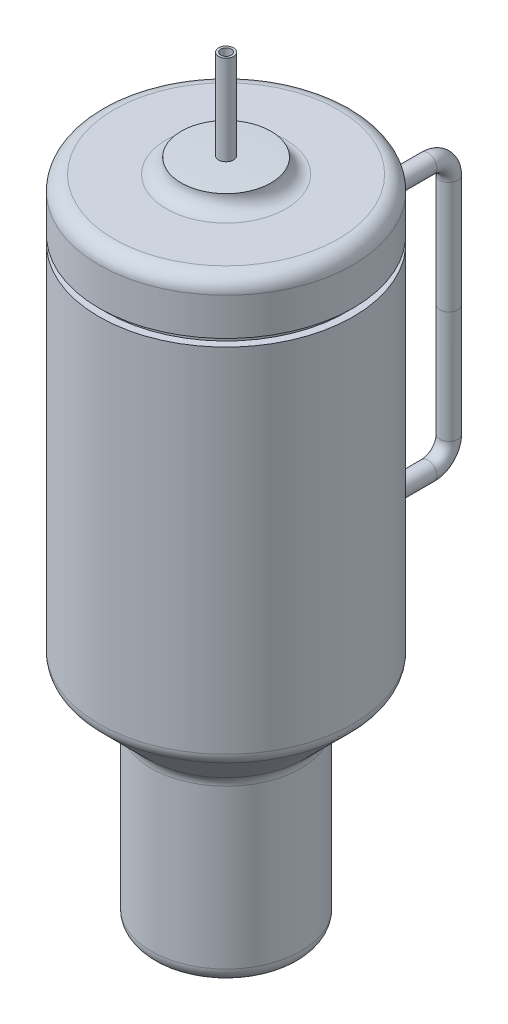
ISO-10303-21;
HEADER;
FILE_DESCRIPTION(('STEP AP214'),'2;1');
FILE_NAME('part.step','',(''),(''),'','','');
FILE_SCHEMA(('AUTOMOTIVE_DESIGN { 1 0 10303 214 1 1 1 1 }'));
ENDSEC;
DATA;
#1=APPLICATION_CONTEXT('core data for automotive mechanical design processes');
#2=APPLICATION_PROTOCOL_DEFINITION('international standard','automotive_design',2000,#1);
#3=PRODUCT_CONTEXT('',#1,'mechanical');
#4=PRODUCT('Part','Part','',(#3));
#5=PRODUCT_RELATED_PRODUCT_CATEGORY('part','',(#4));
#6=PRODUCT_DEFINITION_FORMATION('','',#4);
#7=PRODUCT_DEFINITION_CONTEXT('part definition',#1,'design');
#8=PRODUCT_DEFINITION('design','',#6,#7);
#9=PRODUCT_DEFINITION_SHAPE('','',#8);
#10=(LENGTH_UNIT() NAMED_UNIT(*) SI_UNIT(.MILLI.,.METRE.));
#11=(NAMED_UNIT(*) PLANE_ANGLE_UNIT() SI_UNIT($,.RADIAN.));
#12=(NAMED_UNIT(*) SI_UNIT($,.STERADIAN.) SOLID_ANGLE_UNIT());
#13=UNCERTAINTY_MEASURE_WITH_UNIT(LENGTH_MEASURE(1.E-05),#10,'distance_accuracy_value','');
#14=(GEOMETRIC_REPRESENTATION_CONTEXT(3) GLOBAL_UNCERTAINTY_ASSIGNED_CONTEXT((#13)) GLOBAL_UNIT_ASSIGNED_CONTEXT((#10,
#11,#12)) REPRESENTATION_CONTEXT('',''));
#15=CARTESIAN_POINT('',(0.,0.,0.));
#16=DIRECTION('',(0.,0.,1.));
#17=DIRECTION('',(1.,0.,0.));
#18=AXIS2_PLACEMENT_3D('',#15,#16,#17);
#19=CARTESIAN_POINT('',(0.,19.6,-8.5));
#20=DIRECTION('',(0.,0.,1.));
#21=DIRECTION('',(0.,1.,0.));
#22=AXIS2_PLACEMENT_3D('',#19,#20,#21);
#23=PLANE('',#22);
#24=CARTESIAN_POINT('',(0.,19.6,-8.5));
#25=DIRECTION('',(0.,0.,-1.));
#26=DIRECTION('',(0.,1.,0.));
#27=AXIS2_PLACEMENT_3D('',#24,#25,#26);
#28=CIRCLE('',#27,0.6);
#29=CARTESIAN_POINT('',(0.,20.2,-8.5));
#30=VERTEX_POINT('',#29);
#31=EDGE_CURVE('E79',#30,#30,#28,.T.);
#32=ORIENTED_EDGE('',*,*,#31,.F.);
#33=EDGE_LOOP('',(#32));
#34=FACE_BOUND('',#33,.T.);
#35=ADVANCED_FACE('F65',(#34),#23,.T.);
#36=CARTESIAN_POINT('',(0.,28.5,-14.9));
#37=DIRECTION('',(0.,-1.,0.));
#38=DIRECTION('',(0.,0.,1.));
#39=AXIS2_PLACEMENT_3D('',#36,#37,#38);
#40=PLANE('',#39);
#41=CARTESIAN_POINT('',(0.,28.5,-14.9));
#42=DIRECTION('',(0.,1.,0.));
#43=DIRECTION('',(0.,0.,1.));
#44=AXIS2_PLACEMENT_3D('',#41,#42,#43);
#45=CIRCLE('',#44,0.6);
#46=CARTESIAN_POINT('',(0.,28.5,-14.3));
#47=VERTEX_POINT('',#46);
#48=EDGE_CURVE('E13',#47,#47,#45,.T.);
#49=ORIENTED_EDGE('',*,*,#48,.T.);
#50=EDGE_LOOP('',(#49));
#51=FACE_BOUND('',#50,.T.);
#52=ADVANCED_FACE('F88',(#51),#40,.F.);
#53=CARTESIAN_POINT('',(0.,19.6,-8.5));
#54=DIRECTION('',(0.,0.,-1.));
#55=DIRECTION('',(-1.,0.,0.));
#56=AXIS2_PLACEMENT_3D('',#53,#54,#55);
#57=CYLINDRICAL_SURFACE('',#56,0.6);
#58=CARTESIAN_POINT('',(0.,19.6,-13.5));
#59=DIRECTION('',(0.,0.,-1.));
#60=DIRECTION('',(0.,1.,0.));
#61=AXIS2_PLACEMENT_3D('',#58,#59,#60);
#62=CIRCLE('',#61,0.6);
#63=CARTESIAN_POINT('',(0.,19.,-13.5));
#64=VERTEX_POINT('',#63);
#65=EDGE_CURVE('E75',#64,#64,#62,.T.);
#66=ORIENTED_EDGE('',*,*,#65,.F.);
#67=EDGE_LOOP('',(#66));
#68=FACE_BOUND('',#67,.T.);
#69=ORIENTED_EDGE('',*,*,#31,.T.);
#70=EDGE_LOOP('',(#69));
#71=FACE_BOUND('',#70,.T.);
#72=ADVANCED_FACE('F85',(#68,#71),#57,.T.);
#73=CARTESIAN_POINT('',(0.,21.,-13.5));
#74=DIRECTION('',(-1.,0.,0.));
#75=DIRECTION('',(0.,0.,1.));
#76=AXIS2_PLACEMENT_3D('',#73,#74,#75);
#77=TOROIDAL_SURFACE('',#76,1.40000000000001,0.6);
#78=CARTESIAN_POINT('',(0.,21.,-14.9));
#79=DIRECTION('',(0.,1.,0.));
#80=DIRECTION('',(0.,0.,1.));
#81=AXIS2_PLACEMENT_3D('',#78,#79,#80);
#82=CIRCLE('',#81,0.6);
#83=CARTESIAN_POINT('',(0.,21.,-15.5));
#84=VERTEX_POINT('',#83);
#85=EDGE_CURVE('E71',#84,#84,#82,.T.);
#86=CARTESIAN_POINT('',(0.,21.,-13.5));
#87=DIRECTION('',(-1.,0.,0.));
#88=DIRECTION('',(0.,0.,1.));
#89=AXIS2_PLACEMENT_3D('',#86,#87,#88);
#90=CIRCLE('',#89,2.00000000000001);
#91=EDGE_CURVE('',#84,#64,#90,.T.);
#92=ORIENTED_EDGE('',*,*,#85,.F.);
#93=ORIENTED_EDGE('',*,*,#65,.T.);
#94=ORIENTED_EDGE('',*,*,#91,.T.);
#95=ORIENTED_EDGE('',*,*,#91,.F.);
#96=EDGE_LOOP('',(#92,#94,#93,#95));
#97=FACE_BOUND('',#96,.T.);
#98=ADVANCED_FACE('F95',(#97),#77,.T.);
#99=CARTESIAN_POINT('',(0.,21.,-14.9));
#100=DIRECTION('',(0.,1.,0.));
#101=DIRECTION('',(0.,0.,-1.));
#102=AXIS2_PLACEMENT_3D('',#99,#100,#101);
#103=CYLINDRICAL_SURFACE('',#102,0.6);
#104=ORIENTED_EDGE('',*,*,#48,.F.);
#105=EDGE_LOOP('',(#104));
#106=FACE_BOUND('',#105,.T.);
#107=ORIENTED_EDGE('',*,*,#85,.T.);
#108=EDGE_LOOP('',(#107));
#109=FACE_BOUND('',#108,.T.);
#110=ADVANCED_FACE('F99',(#106,#109),#103,.T.);
#111=CLOSED_SHELL('',(#35,#52,#72,#98,#110));
#112=MANIFOLD_SOLID_BREP('B2',#111);
#113=CARTESIAN_POINT('',(0.,37.4,-8.5));
#114=DIRECTION('',(0.,0.,1.));
#115=DIRECTION('',(0.,-1.,0.));
#116=AXIS2_PLACEMENT_3D('',#113,#114,#115);
#117=PLANE('',#116);
#118=CARTESIAN_POINT('',(0.,37.4,-8.5));
#119=DIRECTION('',(0.,0.,1.));
#120=DIRECTION('',(0.,-1.,0.));
#121=AXIS2_PLACEMENT_3D('',#118,#119,#120);
#122=CIRCLE('',#121,0.6);
#123=CARTESIAN_POINT('',(0.,36.8,-8.5));
#124=VERTEX_POINT('',#123);
#125=EDGE_CURVE('E180',#124,#124,#122,.T.);
#126=ORIENTED_EDGE('',*,*,#125,.T.);
#127=EDGE_LOOP('',(#126));
#128=FACE_BOUND('',#127,.T.);
#129=ADVANCED_FACE('F166',(#128),#117,.T.);
#130=CARTESIAN_POINT('',(0.,28.5,-14.9));
#131=DIRECTION('',(0.,1.,0.));
#132=DIRECTION('',(0.,0.,1.));
#133=AXIS2_PLACEMENT_3D('',#130,#131,#132);
#134=PLANE('',#133);
#135=CARTESIAN_POINT('',(0.,28.5,-14.9));
#136=DIRECTION('',(0.,1.,0.));
#137=DIRECTION('',(0.,0.,1.));
#138=AXIS2_PLACEMENT_3D('',#135,#136,#137);
#139=CIRCLE('',#138,0.6);
#140=CARTESIAN_POINT('',(0.,28.5,-14.3));
#141=VERTEX_POINT('',#140);
#142=EDGE_CURVE('E64',#141,#141,#139,.T.);
#143=ORIENTED_EDGE('',*,*,#142,.F.);
#144=EDGE_LOOP('',(#143));
#145=FACE_BOUND('',#144,.T.);
#146=ADVANCED_FACE('F190',(#145),#134,.F.);
#147=CARTESIAN_POINT('',(0.,37.4,-8.5));
#148=DIRECTION('',(0.,0.,-1.));
#149=DIRECTION('',(-1.,0.,0.));
#150=AXIS2_PLACEMENT_3D('',#147,#148,#149);
#151=CYLINDRICAL_SURFACE('',#150,0.6);
#152=CARTESIAN_POINT('',(0.,37.4,-13.5));
#153=DIRECTION('',(0.,0.,1.));
#154=DIRECTION('',(0.,-1.,0.));
#155=AXIS2_PLACEMENT_3D('',#152,#153,#154);
#156=CIRCLE('',#155,0.6);
#157=CARTESIAN_POINT('',(0.,38.,-13.5));
#158=VERTEX_POINT('',#157);
#159=EDGE_CURVE('E176',#158,#158,#156,.T.);
#160=ORIENTED_EDGE('',*,*,#159,.T.);
#161=EDGE_LOOP('',(#160));
#162=FACE_BOUND('',#161,.T.);
#163=ORIENTED_EDGE('',*,*,#125,.F.);
#164=EDGE_LOOP('',(#163));
#165=FACE_BOUND('',#164,.T.);
#166=ADVANCED_FACE('F187',(#162,#165),#151,.T.);
#167=CARTESIAN_POINT('',(0.,36.,-13.5));
#168=DIRECTION('',(-1.,0.,0.));
#169=DIRECTION('',(0.,0.,1.));
#170=AXIS2_PLACEMENT_3D('',#167,#168,#169);
#171=TOROIDAL_SURFACE('',#170,1.40000000000001,0.6);
#172=CARTESIAN_POINT('',(0.,36.,-14.9));
#173=DIRECTION('',(0.,1.,0.));
#174=DIRECTION('',(0.,0.,1.));
#175=AXIS2_PLACEMENT_3D('',#172,#173,#174);
#176=CIRCLE('',#175,0.6);
#177=CARTESIAN_POINT('',(0.,36.,-15.5));
#178=VERTEX_POINT('',#177);
#179=EDGE_CURVE('E172',#178,#178,#176,.T.);
#180=CARTESIAN_POINT('',(0.,36.,-13.5));
#181=DIRECTION('',(-1.,0.,0.));
#182=DIRECTION('',(0.,0.,1.));
#183=AXIS2_PLACEMENT_3D('',#180,#181,#182);
#184=CIRCLE('',#183,2.00000000000001);
#185=EDGE_CURVE('',#158,#178,#184,.T.);
#186=ORIENTED_EDGE('',*,*,#159,.F.);
#187=ORIENTED_EDGE('',*,*,#179,.T.);
#188=ORIENTED_EDGE('',*,*,#185,.T.);
#189=ORIENTED_EDGE('',*,*,#185,.F.);
#190=EDGE_LOOP('',(#186,#188,#187,#189));
#191=FACE_BOUND('',#190,.T.);
#192=ADVANCED_FACE('F189',(#191),#171,.T.);
#193=CARTESIAN_POINT('',(0.,36.,-14.9));
#194=DIRECTION('',(0.,-1.,0.));
#195=DIRECTION('',(0.,0.,-1.));
#196=AXIS2_PLACEMENT_3D('',#193,#194,#195);
#197=CYLINDRICAL_SURFACE('',#196,0.6);
#198=ORIENTED_EDGE('',*,*,#142,.T.);
#199=EDGE_LOOP('',(#198));
#200=FACE_BOUND('',#199,.T.);
#201=ORIENTED_EDGE('',*,*,#179,.F.);
#202=EDGE_LOOP('',(#201));
#203=FACE_BOUND('',#202,.T.);
#204=ADVANCED_FACE('F197',(#200,#203),#197,.T.);
#205=CLOSED_SHELL('',(#129,#146,#166,#192,#204));
#206=MANIFOLD_SOLID_BREP('B8',#205);
#207=CARTESIAN_POINT('',(0.,1.,0.));
#208=DIRECTION('',(0.,-1.,0.));
#209=DIRECTION('',(0.,0.,-1.));
#210=AXIS2_PLACEMENT_3D('',#207,#208,#209);
#211=PLANE('',#210);
#212=CARTESIAN_POINT('',(0.,1.,0.));
#213=DIRECTION('',(0.,1.,0.));
#214=DIRECTION('',(0.,0.,1.));
#215=AXIS2_PLACEMENT_3D('',#212,#213,#214);
#216=CIRCLE('',#215,4.);
#217=CARTESIAN_POINT('',(0.,1.,4.));
#218=VERTEX_POINT('',#217);
#219=EDGE_CURVE('E293',#218,#218,#216,.T.);
#220=ORIENTED_EDGE('',*,*,#219,.T.);
#221=EDGE_LOOP('',(#220));
#222=FACE_BOUND('',#221,.T.);
#223=ADVANCED_FACE('F258',(#222),#211,.F.);
#224=CARTESIAN_POINT('',(0.,32.5899280575539,0.));
#225=DIRECTION('',(0.,1.,0.));
#226=DIRECTION('',(0.,0.,1.));
#227=AXIS2_PLACEMENT_3D('',#224,#225,#226);
#228=CYLINDRICAL_SURFACE('',#227,4.);
#229=CARTESIAN_POINT('',(0.,18.,0.));
#230=DIRECTION('',(0.,1.,0.));
#231=DIRECTION('',(0.,0.,1.));
#232=AXIS2_PLACEMENT_3D('',#229,#230,#231);
#233=CIRCLE('',#232,4.);
#234=CARTESIAN_POINT('',(0.,18.,4.));
#235=VERTEX_POINT('',#234);
#236=EDGE_CURVE('E296',#235,#235,#233,.T.);
#237=ORIENTED_EDGE('',*,*,#236,.T.);
#238=EDGE_LOOP('',(#237));
#239=FACE_BOUND('',#238,.T.);
#240=ORIENTED_EDGE('',*,*,#219,.F.);
#241=EDGE_LOOP('',(#240));
#242=FACE_BOUND('',#241,.T.);
#243=ADVANCED_FACE('F382',(#239,#242),#228,.F.);
#244=CARTESIAN_POINT('',(0.,18.,0.));
#245=DIRECTION('',(0.,1.,0.));
#246=DIRECTION('',(0.,0.,1.));
#247=AXIS2_PLACEMENT_3D('',#244,#245,#246);
#248=PLANE('',#247);
#249=CARTESIAN_POINT('',(0.,18.,0.));
#250=DIRECTION('',(0.,1.,0.));
#251=DIRECTION('',(0.,0.,1.));
#252=AXIS2_PLACEMENT_3D('',#249,#250,#251);
#253=CIRCLE('',#252,7.5);
#254=CARTESIAN_POINT('',(0.,18.,7.5));
#255=VERTEX_POINT('',#254);
#256=EDGE_CURVE('E299',#255,#255,#253,.T.);
#257=ORIENTED_EDGE('',*,*,#256,.T.);
#258=EDGE_LOOP('',(#257));
#259=FACE_BOUND('',#258,.T.);
#260=ORIENTED_EDGE('',*,*,#236,.F.);
#261=EDGE_LOOP('',(#260));
#262=FACE_BOUND('',#261,.T.);
#263=ADVANCED_FACE('F388',(#259,#262),#248,.T.);
#264=CARTESIAN_POINT('',(0.,32.5899280575539,0.));
#265=DIRECTION('',(0.,1.,0.));
#266=DIRECTION('',(0.,0.,1.));
#267=AXIS2_PLACEMENT_3D('',#264,#265,#266);
#268=CYLINDRICAL_SURFACE('',#267,7.5);
#269=CARTESIAN_POINT('',(0.,42.5,0.));
#270=DIRECTION('',(0.,1.,0.));
#271=DIRECTION('',(0.,0.,1.));
#272=AXIS2_PLACEMENT_3D('',#269,#270,#271);
#273=CIRCLE('',#272,7.5);
#274=CARTESIAN_POINT('',(0.,42.5,7.5));
#275=VERTEX_POINT('',#274);
#276=EDGE_CURVE('E302',#275,#275,#273,.T.);
#277=ORIENTED_EDGE('',*,*,#276,.T.);
#278=EDGE_LOOP('',(#277));
#279=FACE_BOUND('',#278,.T.);
#280=ORIENTED_EDGE('',*,*,#256,.F.);
#281=EDGE_LOOP('',(#280));
#282=FACE_BOUND('',#281,.T.);
#283=ADVANCED_FACE('F442',(#279,#282),#268,.F.);
#284=CARTESIAN_POINT('',(0.,42.5,0.));
#285=DIRECTION('',(0.,-1.,0.));
#286=DIRECTION('',(0.,0.,-1.));
#287=AXIS2_PLACEMENT_3D('',#284,#285,#286);
#288=PLANE('',#287);
#289=CARTESIAN_POINT('',(0.,42.5,0.));
#290=DIRECTION('',(0.,1.,0.));
#291=DIRECTION('',(0.,0.,1.));
#292=AXIS2_PLACEMENT_3D('',#289,#290,#291);
#293=CIRCLE('',#292,2.5);
#294=CARTESIAN_POINT('',(0.,42.5,2.5));
#295=VERTEX_POINT('',#294);
#296=EDGE_CURVE('E305',#295,#295,#293,.T.);
#297=ORIENTED_EDGE('',*,*,#296,.T.);
#298=EDGE_LOOP('',(#297));
#299=FACE_BOUND('',#298,.T.);
#300=ORIENTED_EDGE('',*,*,#276,.F.);
#301=EDGE_LOOP('',(#300));
#302=FACE_BOUND('',#301,.T.);
#303=ADVANCED_FACE('F438',(#299,#302),#288,.T.);
#304=CARTESIAN_POINT('',(0.,32.5899280575539,0.));
#305=DIRECTION('',(0.,1.,0.));
#306=DIRECTION('',(0.,0.,1.));
#307=AXIS2_PLACEMENT_3D('',#304,#305,#306);
#308=CYLINDRICAL_SURFACE('',#307,2.5);
#309=CARTESIAN_POINT('',(0.,44.0244776381053,0.));
#310=DIRECTION('',(0.,1.,0.));
#311=DIRECTION('',(0.,0.,1.));
#312=AXIS2_PLACEMENT_3D('',#309,#310,#311);
#313=CIRCLE('',#312,2.5);
#314=CARTESIAN_POINT('',(-2.49999999999995,44.0244776381053,0.));
#315=VERTEX_POINT('',#314);
#316=EDGE_CURVE('E308',#315,#315,#313,.T.);
#317=ORIENTED_EDGE('',*,*,#316,.T.);
#318=EDGE_LOOP('',(#317));
#319=FACE_BOUND('',#318,.T.);
#320=ORIENTED_EDGE('',*,*,#296,.F.);
#321=EDGE_LOOP('',(#320));
#322=FACE_BOUND('',#321,.T.);
#323=ADVANCED_FACE('F434',(#319,#322),#308,.F.);
#324=CARTESIAN_POINT('',(0.,-10.491170900856,0.));
#325=DIRECTION('',(0.,1.,0.));
#326=DIRECTION('',(-1.,0.,0.));
#327=AXIS2_PLACEMENT_3D('',#324,#325,#326);
#328=SPHERICAL_SURFACE('',#327,54.5729414235989);
#329=CARTESIAN_POINT('',(0.,44.0806481601168,0.));
#330=DIRECTION('',(0.,1.,0.));
#331=DIRECTION('',(0.,0.,1.));
#332=AXIS2_PLACEMENT_3D('',#329,#330,#331);
#333=CIRCLE('',#332,0.350000000000003);
#334=CARTESIAN_POINT('',(-0.350000000000009,44.0806481601168,0.));
#335=VERTEX_POINT('',#334);
#336=EDGE_CURVE('E311',#335,#335,#333,.T.);
#337=CARTESIAN_POINT('',(-0.350000000000009,44.0806481601168,0.));
#338=CARTESIAN_POINT('',(-0.372404464580935,44.0805044675969,0.));
#339=CARTESIAN_POINT('',(-0.394808840672282,44.0803469778303,0.));
#340=CARTESIAN_POINT('',(-0.439617381889484,44.0800044040754,0.));
#341=CARTESIAN_POINT('',(-0.462021547015338,44.0798193200871,0.));
#342=CARTESIAN_POINT('',(-0.506829632315215,44.0794215581608,0.));
#343=CARTESIAN_POINT('',(-0.529233552489238,44.0792088802228,0.));
#344=CARTESIAN_POINT('',(-0.574041113899573,44.0787559307219,0.));
#345=CARTESIAN_POINT('',(-0.596444755135886,44.0785156591592,0.));
#346=CARTESIAN_POINT('',(-0.64125172468532,44.0780075227727,0.));
#347=CARTESIAN_POINT('',(-0.663655052998442,44.077739657949,0.));
#348=CARTESIAN_POINT('',(-0.708461362716497,44.0771763354473,0.));
#349=CARTESIAN_POINT('',(-0.73086434412143,44.0768808777692,0.));
#350=CARTESIAN_POINT('',(-0.775669926038632,44.0762623700069,0.));
#351=CARTESIAN_POINT('',(-0.798072526550901,44.0759393199226,0.));
#352=CARTESIAN_POINT('',(-0.84287731269888,44.0752656278378,0.));
#353=CARTESIAN_POINT('',(-0.86527949833459,44.0749149858373,0.));
#354=CARTESIAN_POINT('',(-0.910083420746179,44.0741861104522,0.));
#355=CARTESIAN_POINT('',(-0.932485157522058,44.0738078770674,0.));
#356=CARTESIAN_POINT('',(-0.977288148231409,44.0730238194875,0.));
#357=CARTESIAN_POINT('',(-0.999689402164881,44.0726179952923,0.));
#358=CARTESIAN_POINT('',(-1.04449139320756,44.0717787567069,0.));
#359=CARTESIAN_POINT('',(-1.06689213031676,44.0713453423169,0.));
#360=CARTESIAN_POINT('',(-1.11169305372984,44.0704509239993,0.));
#361=CARTESIAN_POINT('',(-1.13409324003371,44.0699899200718,0.));
#362=CARTESIAN_POINT('',(-1.17889302785588,44.0690403233787,0.));
#363=CARTESIAN_POINT('',(-1.20129262937419,44.0685517306131,0.));
#364=CARTESIAN_POINT('',(-1.24609121364588,44.0675469569851,0.));
#365=CARTESIAN_POINT('',(-1.26849019639926,44.0670307761226,0.));
#366=CARTESIAN_POINT('',(-1.31328750916271,44.0659708270838,0.));
#367=CARTESIAN_POINT('',(-1.33568583917277,44.0654270589075,0.));
#368=CARTESIAN_POINT('',(-1.38048181247216,44.0643119360658,0.));
#369=CARTESIAN_POINT('',(-1.40287945576148,44.0637405814004,0.));
#370=CARTESIAN_POINT('',(-1.44767402164301,44.0625702864475,0.));
#371=CARTESIAN_POINT('',(-1.47007094423521,44.0619713461599,0.));
#372=CARTESIAN_POINT('',(-1.51486403474722,44.060745880871,0.));
#373=CARTESIAN_POINT('',(-1.53726020266702,44.0601193558696,0.));
#374=CARTESIAN_POINT('',(-1.58205174986009,44.0588387221037,0.));
#375=CARTESIAN_POINT('',(-1.60444712913335,44.0581846133391,0.));
#376=CARTESIAN_POINT('',(-1.6492370650604,44.0568488130389,0.));
#377=CARTESIAN_POINT('',(-1.67163162171418,44.0561671215032,0.));
#378=CARTESIAN_POINT('',(-1.71641987843058,44.054776156695,0.));
#379=CARTESIAN_POINT('',(-1.73881357849319,44.0540668834225,0.));
#380=CARTESIAN_POINT('',(-1.78360008805684,44.0526207562164,0.));
#381=CARTESIAN_POINT('',(-1.80599289755788,44.0518839022828,0.));
#382=CARTESIAN_POINT('',(-1.85077759202935,44.0503826148725,0.));
#383=CARTESIAN_POINT('',(-1.87316947699977,44.0496181813957,0.));
#384=CARTESIAN_POINT('',(-1.91795228844237,44.0480617360586,0.));
#385=CARTESIAN_POINT('',(-1.94034321491455,44.0472697241983,0.));
#386=CARTESIAN_POINT('',(-1.98512407539445,44.0456581232954,0.));
#387=CARTESIAN_POINT('',(-2.00751400940218,44.0448385342529,0.));
#388=CARTESIAN_POINT('',(-2.05229285098853,44.0431717802291,0.));
#389=CARTESIAN_POINT('',(-2.07468175856715,44.0423246152477,0.));
#390=CARTESIAN_POINT('',(-2.11945851333212,44.0406027106313,0.));
#391=CARTESIAN_POINT('',(-2.14184636051849,44.0397279709962,0.));
#392=CARTESIAN_POINT('',(-2.18662096053746,44.0379509183992,0.));
#393=CARTESIAN_POINT('',(-2.20900771337007,44.0370486054373,0.));
#394=CARTESIAN_POINT('',(-2.25378009072165,44.0352164075555,0.));
#395=CARTESIAN_POINT('',(-2.27616571524063,44.0342865226355,0.));
#396=CARTESIAN_POINT('',(-2.32093580200686,44.0323991822485,0.));
#397=CARTESIAN_POINT('',(-2.3433202642541,44.0314417267816,0.));
#398=CARTESIAN_POINT('',(-2.38808799252036,44.0294992467509,0.));
#399=CARTESIAN_POINT('',(-2.41047125853937,44.0285142221871,0.));
#400=CARTESIAN_POINT('',(-2.455236560395,44.0265166054658,0.));
#401=CARTESIAN_POINT('',(-2.47761859623162,44.0255040133082,0.));
#402=CARTESIAN_POINT('',(-2.49999999999995,44.0244776381053,0.));
#403=B_SPLINE_CURVE_WITH_KNOTS('',3,(#337,#338,#339,#340,#341,#342,#343,#344,#345,#346,#347,
#348,#349,#350,#351,#352,#353,#354,#355,#356,#357,#358,#359,#360,#361,#362,#363,#364,#365,#366,
#367,#368,#369,#370,#371,#372,#373,#374,#375,#376,#377,#378,#379,#380,#381,#382,#383,#384,#385,
#386,#387,#388,#389,#390,#391,#392,#393,#394,#395,#396,#397,#398,#399,#400,#401,#402),
.UNSPECIFIED.,.F.,.F.,(4,2,2,2,2,2,2,2,2,2,2,2,2,2,2,2,2,2,2,2,2,2,2,2,2,2,2,2,2,2,2,2,4),(0.,
0.0672147718523692,0.134429543704738,0.201644315557107,0.268859087409476,0.336073859261846,
0.403288631114215,0.470503402966584,0.537718174818953,0.60493294667131,0.672147718523679,
0.739362490376048,0.806577262228418,0.873792034080787,0.941006805933156,1.00822157778552,
1.07543634963789,1.14265112149026,1.20986589334263,1.277080665195,1.34429543704737,
1.41151020889974,1.47872498075211,1.54593975260448,1.61315452445683,1.6803692963092,
1.74758406816157,1.81479884001394,1.88201361186631,1.94922838371868,2.01644315557105,
2.08365792742342,2.15087269927579),.UNSPECIFIED.);
#404=EDGE_CURVE('BSEAM430',#335,#315,#403,.T.);
#405=ORIENTED_EDGE('',*,*,#336,.T.);
#406=ORIENTED_EDGE('',*,*,#316,.F.);
#407=ORIENTED_EDGE('',*,*,#404,.T.);
#408=ORIENTED_EDGE('',*,*,#404,.F.);
#409=EDGE_LOOP('',(#405,#407,#406,#408));
#410=FACE_BOUND('',#409,.T.);
#411=ADVANCED_FACE('F430',(#410),#328,.F.);
#412=CARTESIAN_POINT('',(0.,32.5899280575539,0.));
#413=DIRECTION('',(0.,1.,0.));
#414=DIRECTION('',(0.,0.,1.));
#415=AXIS2_PLACEMENT_3D('',#412,#413,#414);
#416=CYLINDRICAL_SURFACE('',#415,0.350000000000002);
#417=ORIENTED_EDGE('',*,*,#336,.F.);
#418=EDGE_LOOP('',(#417));
#419=FACE_BOUND('',#418,.T.);
#420=CARTESIAN_POINT('',(0.,50.5795007588137,0.));
#421=DIRECTION('',(0.,1.,0.));
#422=DIRECTION('',(0.,0.,1.));
#423=AXIS2_PLACEMENT_3D('',#420,#421,#422);
#424=CIRCLE('',#423,0.350000000000002);
#425=CARTESIAN_POINT('',(0.,50.5795007588137,0.350000000000002));
#426=VERTEX_POINT('',#425);
#427=EDGE_CURVE('E314',#426,#426,#424,.T.);
#428=ORIENTED_EDGE('',*,*,#427,.T.);
#429=EDGE_LOOP('',(#428));
#430=FACE_BOUND('',#429,.T.);
#431=ADVANCED_FACE('F426',(#419,#430),#416,.F.);
#432=CARTESIAN_POINT('',(0.,50.5795007588137,0.));
#433=DIRECTION('',(0.,-1.,0.));
#434=DIRECTION('',(0.,0.,-1.));
#435=AXIS2_PLACEMENT_3D('',#432,#433,#434);
#436=PLANE('',#435);
#437=ORIENTED_EDGE('',*,*,#427,.F.);
#438=EDGE_LOOP('',(#437));
#439=FACE_BOUND('',#438,.T.);
#440=CARTESIAN_POINT('',(0.,50.5795007588137,0.));
#441=DIRECTION('',(0.,1.,0.));
#442=DIRECTION('',(0.,0.,1.));
#443=AXIS2_PLACEMENT_3D('',#440,#441,#442);
#444=CIRCLE('',#443,0.500000000000002);
#445=CARTESIAN_POINT('',(0.,50.5795007588137,0.500000000000002));
#446=VERTEX_POINT('',#445);
#447=EDGE_CURVE('E317',#446,#446,#444,.T.);
#448=ORIENTED_EDGE('',*,*,#447,.T.);
#449=EDGE_LOOP('',(#448));
#450=FACE_BOUND('',#449,.T.);
#451=ADVANCED_FACE('F419',(#439,#450),#436,.F.);
#452=CARTESIAN_POINT('',(0.,32.5899280575539,0.));
#453=DIRECTION('',(0.,1.,0.));
#454=DIRECTION('',(0.,0.,1.));
#455=AXIS2_PLACEMENT_3D('',#452,#453,#454);
#456=CYLINDRICAL_SURFACE('',#455,0.500000000000002);
#457=ORIENTED_EDGE('',*,*,#447,.F.);
#458=EDGE_LOOP('',(#457));
#459=FACE_BOUND('',#458,.T.);
#460=CARTESIAN_POINT('',(0.,44.5795007588138,0.));
#461=DIRECTION('',(0.,1.,0.));
#462=DIRECTION('',(0.,0.,1.));
#463=AXIS2_PLACEMENT_3D('',#460,#461,#462);
#464=CIRCLE('',#463,0.500000000000002);
#465=CARTESIAN_POINT('',(-0.499999999999619,44.5795007588137,0.));
#466=VERTEX_POINT('',#465);
#467=EDGE_CURVE('E320',#466,#466,#464,.T.);
#468=ORIENTED_EDGE('',*,*,#467,.T.);
#469=EDGE_LOOP('',(#468));
#470=FACE_BOUND('',#469,.T.);
#471=ADVANCED_FACE('F410',(#459,#470),#456,.T.);
#472=CARTESIAN_POINT('',(0.,-10.491170900856,0.));
#473=DIRECTION('',(0.,1.,0.));
#474=DIRECTION('',(-1.,0.,0.));
#475=AXIS2_PLACEMENT_3D('',#472,#473,#474);
#476=SPHERICAL_SURFACE('',#475,55.0729414235989);
#477=CARTESIAN_POINT('',(0.,44.5,0.));
#478=DIRECTION('',(0.,1.,0.));
#479=DIRECTION('',(0.,0.,1.));
#480=AXIS2_PLACEMENT_3D('',#477,#478,#479);
#481=CIRCLE('',#480,3.);
#482=CARTESIAN_POINT('',(-3.00000000000014,44.5,0.));
#483=VERTEX_POINT('',#482);
#484=EDGE_CURVE('E323',#483,#483,#481,.T.);
#485=CARTESIAN_POINT('',(-0.499999999999619,44.5795007588137,0.));
#486=CARTESIAN_POINT('',(-0.526055996724531,44.5792641901061,0.));
#487=CARTESIAN_POINT('',(-0.552111825554893,44.5790091292706,0.));
#488=CARTESIAN_POINT('',(-0.60422309493164,44.578462023917,0.));
#489=CARTESIAN_POINT('',(-0.630278535478027,44.5781699793987,0.));
#490=CARTESIAN_POINT('',(-0.682388975791963,44.577548907252,0.));
#491=CARTESIAN_POINT('',(-0.708443975559512,44.5772198796235,0.));
#492=CARTESIAN_POINT('',(-0.760553481821995,44.5765248419236,0.));
#493=CARTESIAN_POINT('',(-0.786607988316929,44.576158831852,0.));
#494=CARTESIAN_POINT('',(-0.838716455541353,44.5753898300022,0.));
#495=CARTESIAN_POINT('',(-0.864770416270844,44.5749868382239,0.));
#496=CARTESIAN_POINT('',(-0.916877739472659,44.5741438737727,0.));
#497=CARTESIAN_POINT('',(-0.942931101944984,44.5737039010998,0.));
#498=CARTESIAN_POINT('',(-0.995037176141945,44.5727869757458,0.));
#499=CARTESIAN_POINT('',(-1.02108988786658,44.5723100230647,0.));
#500=CARTESIAN_POINT('',(-1.07319460807897,44.5713191386552,0.));
#501=CARTESIAN_POINT('',(-1.09924661656672,44.5708052069268,0.));
#502=CARTESIAN_POINT('',(-1.15134987781754,44.5697403654583,0.));
#503=CARTESIAN_POINT('',(-1.17740113058061,44.569189455718,0.));
#504=CARTESIAN_POINT('',(-1.2295028278958,44.5680506593357,0.));
#505=CARTESIAN_POINT('',(-1.25555327244792,44.5674627726936,0.));
#506=CARTESIAN_POINT('',(-1.30765330085657,44.5662500236919,0.));
#507=CARTESIAN_POINT('',(-1.33370288471311,44.5656251613323,0.));
#508=CARTESIAN_POINT('',(-1.38580113924769,44.5643384621545,0.));
#509=CARTESIAN_POINT('',(-1.41184980992574,44.5636766253364,0.));
#510=CARTESIAN_POINT('',(-1.46394618562228,44.562315978575,0.));
#511=CARTESIAN_POINT('',(-1.48999389064077,44.5616171686318,0.));
#512=CARTESIAN_POINT('',(-1.54208828253908,44.5601825770281,0.));
#513=CARTESIAN_POINT('',(-1.5681349694189,44.5594467953676,0.));
#514=CARTESIAN_POINT('',(-1.62022727256279,44.5579382618119,0.));
#515=CARTESIAN_POINT('',(-1.64627288882686,44.5571655099166,0.));
#516=CARTESIAN_POINT('',(-1.69836299826436,44.5555830374482,0.));
#517=CARTESIAN_POINT('',(-1.72440749143779,44.554773316875,0.));
#518=CARTESIAN_POINT('',(-1.77649530222134,44.5531169086821,0.));
#519=CARTESIAN_POINT('',(-1.80253861983146,44.5522702210624,0.));
#520=CARTESIAN_POINT('',(-1.85462402701813,44.5505398804823,0.));
#521=CARTESIAN_POINT('',(-1.88066611659467,44.5496562275219,0.));
#522=CARTESIAN_POINT('',(-1.93274901524637,44.5478519580406,0.));
#523=CARTESIAN_POINT('',(-1.95878982432153,44.5469313415198,0.));
#524=CARTESIAN_POINT('',(-2.01087010950523,44.5450531467727,0.));
#525=CARTESIAN_POINT('',(-2.03690958561377,44.5440955685463,0.));
#526=CARTESIAN_POINT('',(-2.08898715240171,44.5421434523172,0.));
#527=CARTESIAN_POINT('',(-2.11502524308111,44.5411489143145,0.));
#528=CARTESIAN_POINT('',(-2.167099986551,44.5391228805366,0.));
#529=CARTESIAN_POINT('',(-2.19313663934149,44.5380913847613,0.));
#530=CARTESIAN_POINT('',(-2.24520845457673,44.5359914375163,0.));
#531=CARTESIAN_POINT('',(-2.27124361702146,44.5349229860466,0.));
#532=CARTESIAN_POINT('',(-2.32331239911134,44.5327491295655,0.));
#533=CARTESIAN_POINT('',(-2.34934601875649,44.531643724554,0.));
#534=CARTESIAN_POINT('',(-2.40141166279643,44.5293959632165,0.));
#535=CARTESIAN_POINT('',(-2.42744368719122,44.5282536068903,0.));
#536=CARTESIAN_POINT('',(-2.47950608828295,44.525931945225,0.));
#537=CARTESIAN_POINT('',(-2.50553646497987,44.5247526398857,0.));
#538=CARTESIAN_POINT('',(-2.55759551823165,44.5223570825701,0.));
#539=CARTESIAN_POINT('',(-2.5836241947865,44.5211408305937,0.));
#540=CARTESIAN_POINT('',(-2.63567979531335,44.5186713824542,0.));
#541=CARTESIAN_POINT('',(-2.66170671928535,44.5174181862911,0.));
#542=CARTESIAN_POINT('',(-2.71375876220922,44.5148748523029,0.));
#543=CARTESIAN_POINT('',(-2.73978388116109,44.5135847144777,0.));
#544=CARTESIAN_POINT('',(-2.79183226161116,44.5109674997656,0.));
#545=CARTESIAN_POINT('',(-2.81785552310936,44.5096404228788,0.));
#546=CARTESIAN_POINT('',(-2.86990013622198,44.5069493327128,0.));
#547=CARTESIAN_POINT('',(-2.8959214878364,44.5055853194337,0.));
#548=CARTESIAN_POINT('',(-2.94796222875629,44.5028203592472,0.));
#549=CARTESIAN_POINT('',(-2.97398161806175,44.5014194123397,0.));
#550=CARTESIAN_POINT('',(-3.00000000000014,44.5,0.));
#551=B_SPLINE_CURVE_WITH_KNOTS('',3,(#485,#486,#487,#488,#489,#490,#491,#492,#493,#494,#495,
#496,#497,#498,#499,#500,#501,#502,#503,#504,#505,#506,#507,#508,#509,#510,#511,#512,#513,#514,
#515,#516,#517,#518,#519,#520,#521,#522,#523,#524,#525,#526,#527,#528,#529,#530,#531,#532,#533,
#534,#535,#536,#537,#538,#539,#540,#541,#542,#543,#544,#545,#546,#547,#548,#549,#550),
.UNSPECIFIED.,.F.,.F.,(4,2,2,2,2,2,2,2,2,2,2,2,2,2,2,2,2,2,2,2,2,2,2,2,2,2,2,2,2,2,2,2,4),(0.,
0.0781712053429667,0.156342410685921,0.234513616028888,0.312684821371843,0.390856026714809,
0.469027232057776,0.547198437400731,0.625369642743698,0.703540848086664,0.781712053429619,
0.859883258772586,0.938054464115552,1.01622566945851,1.09439687480147,1.17256808014443,
1.2507392854874,1.32891049083036,1.40708169617332,1.48525290151628,1.56342410685924,
1.6415953122022,1.71976651754517,1.79793772288813,1.87610892823109,1.95428013357406,
2.03245133891701,2.11062254425998,2.18879374960295,2.2669649549459,2.34513616028887,
2.42330736563182,2.50147857097479),.UNSPECIFIED.);
#552=EDGE_CURVE('BSEAM408',#466,#483,#551,.T.);
#553=ORIENTED_EDGE('',*,*,#467,.F.);
#554=ORIENTED_EDGE('',*,*,#484,.T.);
#555=ORIENTED_EDGE('',*,*,#552,.T.);
#556=ORIENTED_EDGE('',*,*,#552,.F.);
#557=EDGE_LOOP('',(#553,#555,#554,#556));
#558=FACE_BOUND('',#557,.T.);
#559=ADVANCED_FACE('F408',(#558),#476,.T.);
#560=CARTESIAN_POINT('',(0.,43.5,0.));
#561=DIRECTION('',(0.,-1.,0.));
#562=DIRECTION('',(0.,0.,-1.));
#563=AXIS2_PLACEMENT_3D('',#560,#561,#562);
#564=PLANE('',#563);
#565=CARTESIAN_POINT('',(0.,43.5,0.));
#566=DIRECTION('',(0.,-1.,0.));
#567=DIRECTION('',(0.,0.,-1.));
#568=AXIS2_PLACEMENT_3D('',#565,#566,#567);
#569=CIRCLE('',#568,4.);
#570=CARTESIAN_POINT('',(0.,43.5,-4.));
#571=VERTEX_POINT('',#570);
#572=EDGE_CURVE('E287',#571,#571,#569,.T.);
#573=ORIENTED_EDGE('',*,*,#572,.T.);
#574=EDGE_LOOP('',(#573));
#575=FACE_BOUND('',#574,.T.);
#576=CARTESIAN_POINT('',(0.,43.5,0.));
#577=DIRECTION('',(0.,-1.,0.));
#578=DIRECTION('',(0.,0.,-1.));
#579=AXIS2_PLACEMENT_3D('',#576,#577,#578);
#580=CIRCLE('',#579,7.5);
#581=CARTESIAN_POINT('',(0.,43.5,-7.5));
#582=VERTEX_POINT('',#581);
#583=EDGE_CURVE('E290',#582,#582,#580,.F.);
#584=ORIENTED_EDGE('',*,*,#583,.T.);
#585=EDGE_LOOP('',(#584));
#586=FACE_BOUND('',#585,.T.);
#587=ADVANCED_FACE('F403',(#575,#586),#564,.F.);
#588=CARTESIAN_POINT('',(0.,32.5899280575539,0.));
#589=DIRECTION('',(0.,1.,0.));
#590=DIRECTION('',(0.,0.,1.));
#591=AXIS2_PLACEMENT_3D('',#588,#589,#590);
#592=CYLINDRICAL_SURFACE('',#591,8.5);
#593=CARTESIAN_POINT('',(0.,40.,0.));
#594=DIRECTION('',(0.,1.,0.));
#595=DIRECTION('',(0.,0.,1.));
#596=AXIS2_PLACEMENT_3D('',#593,#594,#595);
#597=CIRCLE('',#596,8.5);
#598=CARTESIAN_POINT('',(0.,40.,8.5));
#599=VERTEX_POINT('',#598);
#600=EDGE_CURVE('E335',#599,#599,#597,.T.);
#601=ORIENTED_EDGE('',*,*,#600,.T.);
#602=EDGE_LOOP('',(#601));
#603=FACE_BOUND('',#602,.T.);
#604=CARTESIAN_POINT('',(0.,42.5,0.));
#605=DIRECTION('',(0.,-1.,0.));
#606=DIRECTION('',(0.,0.,-1.));
#607=AXIS2_PLACEMENT_3D('',#604,#605,#606);
#608=CIRCLE('',#607,8.5);
#609=CARTESIAN_POINT('',(0.,42.5,-8.5));
#610=VERTEX_POINT('',#609);
#611=EDGE_CURVE('E284',#610,#610,#608,.T.);
#612=ORIENTED_EDGE('',*,*,#611,.T.);
#613=EDGE_LOOP('',(#612));
#614=FACE_BOUND('',#613,.T.);
#615=ADVANCED_FACE('F339',(#603,#614),#592,.T.);
#616=CARTESIAN_POINT('',(0.,44.5,0.));
#617=DIRECTION('',(0.,-1.,0.));
#618=DIRECTION('',(0.,0.,-1.));
#619=AXIS2_PLACEMENT_3D('',#616,#617,#618);
#620=TOROIDAL_SURFACE('',#619,4.,1.);
#621=ORIENTED_EDGE('',*,*,#572,.F.);
#622=EDGE_LOOP('',(#621));
#623=FACE_BOUND('',#622,.T.);
#624=ORIENTED_EDGE('',*,*,#484,.F.);
#625=EDGE_LOOP('',(#624));
#626=FACE_BOUND('',#625,.T.);
#627=ADVANCED_FACE('F395',(#623,#626),#620,.F.);
#628=CARTESIAN_POINT('',(0.,42.5,0.));
#629=DIRECTION('',(0.,-1.,0.));
#630=DIRECTION('',(0.,0.,-1.));
#631=AXIS2_PLACEMENT_3D('',#628,#629,#630);
#632=TOROIDAL_SURFACE('',#631,7.5,1.);
#633=ORIENTED_EDGE('',*,*,#611,.F.);
#634=EDGE_LOOP('',(#633));
#635=FACE_BOUND('',#634,.T.);
#636=ORIENTED_EDGE('',*,*,#583,.F.);
#637=EDGE_LOOP('',(#636));
#638=FACE_BOUND('',#637,.T.);
#639=ADVANCED_FACE('F260',(#635,#638),#632,.T.);
#640=CARTESIAN_POINT('',(-8.5,39.5,0.));
#641=DIRECTION('',(0.,-1.,0.));
#642=DIRECTION('',(0.,0.,-1.));
#643=AXIS2_PLACEMENT_3D('',#640,#641,#642);
#644=PLANE('',#643);
#645=CARTESIAN_POINT('',(0.,39.5,0.));
#646=DIRECTION('',(0.,1.,0.));
#647=DIRECTION('',(0.,0.,1.));
#648=AXIS2_PLACEMENT_3D('',#645,#646,#647);
#649=CIRCLE('',#648,8.);
#650=CARTESIAN_POINT('',(0.,39.5,8.));
#651=VERTEX_POINT('',#650);
#652=EDGE_CURVE('E329',#651,#651,#649,.T.);
#653=ORIENTED_EDGE('',*,*,#652,.F.);
#654=EDGE_LOOP('',(#653));
#655=FACE_BOUND('',#654,.T.);
#656=CARTESIAN_POINT('',(0.,39.5,0.));
#657=DIRECTION('',(0.,1.,0.));
#658=DIRECTION('',(0.,0.,1.));
#659=AXIS2_PLACEMENT_3D('',#656,#657,#658);
#660=CIRCLE('',#659,8.5);
#661=CARTESIAN_POINT('',(0.,39.5,8.5));
#662=VERTEX_POINT('',#661);
#663=EDGE_CURVE('E326',#662,#662,#660,.T.);
#664=ORIENTED_EDGE('',*,*,#663,.T.);
#665=EDGE_LOOP('',(#664));
#666=FACE_BOUND('',#665,.T.);
#667=ADVANCED_FACE('F352',(#655,#666),#644,.F.);
#668=CARTESIAN_POINT('',(0.,32.5899280575539,0.));
#669=DIRECTION('',(0.,1.,0.));
#670=DIRECTION('',(0.,0.,1.));
#671=AXIS2_PLACEMENT_3D('',#668,#669,#670);
#672=CYLINDRICAL_SURFACE('',#671,8.);
#673=CARTESIAN_POINT('',(0.,40.,0.));
#674=DIRECTION('',(0.,1.,0.));
#675=DIRECTION('',(0.,0.,1.));
#676=AXIS2_PLACEMENT_3D('',#673,#674,#675);
#677=CIRCLE('',#676,8.);
#678=CARTESIAN_POINT('',(0.,40.,8.));
#679=VERTEX_POINT('',#678);
#680=EDGE_CURVE('E332',#679,#679,#677,.T.);
#681=ORIENTED_EDGE('',*,*,#680,.F.);
#682=EDGE_LOOP('',(#681));
#683=FACE_BOUND('',#682,.T.);
#684=ORIENTED_EDGE('',*,*,#652,.T.);
#685=EDGE_LOOP('',(#684));
#686=FACE_BOUND('',#685,.T.);
#687=ADVANCED_FACE('F346',(#683,#686),#672,.T.);
#688=CARTESIAN_POINT('',(-8.5,40.,0.));
#689=DIRECTION('',(0.,1.,0.));
#690=DIRECTION('',(0.,0.,1.));
#691=AXIS2_PLACEMENT_3D('',#688,#689,#690);
#692=PLANE('',#691);
#693=ORIENTED_EDGE('',*,*,#600,.F.);
#694=EDGE_LOOP('',(#693));
#695=FACE_BOUND('',#694,.T.);
#696=ORIENTED_EDGE('',*,*,#680,.T.);
#697=EDGE_LOOP('',(#696));
#698=FACE_BOUND('',#697,.T.);
#699=ADVANCED_FACE('F342',(#695,#698),#692,.F.);
#700=CARTESIAN_POINT('',(0.,0.,0.));
#701=DIRECTION('',(0.,-1.,0.));
#702=DIRECTION('',(0.,0.,-1.));
#703=AXIS2_PLACEMENT_3D('',#700,#701,#702);
#704=PLANE('',#703);
#705=CARTESIAN_POINT('',(0.,0.,0.));
#706=DIRECTION('',(0.,-1.,0.));
#707=DIRECTION('',(0.,0.,-1.));
#708=AXIS2_PLACEMENT_3D('',#705,#706,#707);
#709=CIRCLE('',#708,4.);
#710=CARTESIAN_POINT('',(0.,0.,-4.));
#711=VERTEX_POINT('',#710);
#712=EDGE_CURVE('E165',#711,#711,#709,.T.);
#713=ORIENTED_EDGE('',*,*,#712,.T.);
#714=EDGE_LOOP('',(#713));
#715=FACE_BOUND('',#714,.T.);
#716=ADVANCED_FACE('F345',(#715),#704,.T.);
#717=CARTESIAN_POINT('',(0.,1.,0.));
#718=DIRECTION('',(0.,-1.,0.));
#719=DIRECTION('',(0.,0.,-1.));
#720=AXIS2_PLACEMENT_3D('',#717,#718,#719);
#721=TOROIDAL_SURFACE('',#720,4.,1.);
#722=ORIENTED_EDGE('',*,*,#712,.F.);
#723=EDGE_LOOP('',(#722));
#724=FACE_BOUND('',#723,.T.);
#725=CARTESIAN_POINT('',(0.,1.,0.));
#726=DIRECTION('',(0.,-1.,0.));
#727=DIRECTION('',(0.,0.,-1.));
#728=AXIS2_PLACEMENT_3D('',#725,#726,#727);
#729=CIRCLE('',#728,5.);
#730=CARTESIAN_POINT('',(0.,1.,-5.));
#731=VERTEX_POINT('',#730);
#732=EDGE_CURVE('E269',#731,#731,#729,.F.);
#733=ORIENTED_EDGE('',*,*,#732,.F.);
#734=EDGE_LOOP('',(#733));
#735=FACE_BOUND('',#734,.T.);
#736=ADVANCED_FACE('F537',(#724,#735),#721,.T.);
#737=CARTESIAN_POINT('',(0.,32.5899280575539,0.));
#738=DIRECTION('',(0.,1.,0.));
#739=DIRECTION('',(0.,0.,1.));
#740=AXIS2_PLACEMENT_3D('',#737,#738,#739);
#741=CYLINDRICAL_SURFACE('',#740,5.);
#742=CARTESIAN_POINT('',(0.,11.5857864376269,0.));
#743=DIRECTION('',(0.,-1.,0.));
#744=DIRECTION('',(0.,0.,-1.));
#745=AXIS2_PLACEMENT_3D('',#742,#743,#744);
#746=CIRCLE('',#745,5.);
#747=CARTESIAN_POINT('',(0.,11.5857864376269,-5.));
#748=VERTEX_POINT('',#747);
#749=EDGE_CURVE('E265',#748,#748,#746,.T.);
#750=ORIENTED_EDGE('',*,*,#749,.T.);
#751=EDGE_LOOP('',(#750));
#752=FACE_BOUND('',#751,.T.);
#753=ORIENTED_EDGE('',*,*,#732,.T.);
#754=EDGE_LOOP('',(#753));
#755=FACE_BOUND('',#754,.T.);
#756=ADVANCED_FACE('F532',(#752,#755),#741,.T.);
#757=CARTESIAN_POINT('',(0.,11.5857864376269,0.));
#758=DIRECTION('',(0.,-1.,0.));
#759=DIRECTION('',(0.,0.,-1.));
#760=AXIS2_PLACEMENT_3D('',#757,#758,#759);
#761=TOROIDAL_SURFACE('',#760,6.,1.);
#762=CARTESIAN_POINT('',(0.,12.2928932188134,0.));
#763=DIRECTION('',(0.,1.,0.));
#764=DIRECTION('',(0.,0.,1.));
#765=AXIS2_PLACEMENT_3D('',#762,#763,#764);
#766=CIRCLE('',#765,5.29289321881346);
#767=CARTESIAN_POINT('',(0.,12.2928932188134,5.29289321881346));
#768=VERTEX_POINT('',#767);
#769=EDGE_CURVE('E278',#768,#768,#766,.T.);
#770=ORIENTED_EDGE('',*,*,#769,.F.);
#771=EDGE_LOOP('',(#770));
#772=FACE_BOUND('',#771,.T.);
#773=ORIENTED_EDGE('',*,*,#749,.F.);
#774=EDGE_LOOP('',(#773));
#775=FACE_BOUND('',#774,.T.);
#776=ADVANCED_FACE('F375',(#772,#775),#761,.F.);
#777=CARTESIAN_POINT('',(0.,17.,0.));
#778=DIRECTION('',(0.,1.,0.));
#779=DIRECTION('',(0.,0.,1.));
#780=AXIS2_PLACEMENT_3D('',#777,#778,#779);
#781=CONICAL_SURFACE('',#780,10.0000000000001,0.785398163397454);
#782=CARTESIAN_POINT('',(0.,15.2071067811865,0.));
#783=DIRECTION('',(0.,-1.,0.));
#784=DIRECTION('',(0.,0.,-1.));
#785=AXIS2_PLACEMENT_3D('',#782,#783,#784);
#786=CIRCLE('',#785,8.20710678118654);
#787=CARTESIAN_POINT('',(0.,15.2071067811865,-8.20710678118654));
#788=VERTEX_POINT('',#787);
#789=EDGE_CURVE('E273',#788,#788,#786,.T.);
#790=ORIENTED_EDGE('',*,*,#789,.T.);
#791=EDGE_LOOP('',(#790));
#792=FACE_BOUND('',#791,.T.);
#793=ORIENTED_EDGE('',*,*,#769,.T.);
#794=EDGE_LOOP('',(#793));
#795=FACE_BOUND('',#794,.T.);
#796=ADVANCED_FACE('F369',(#792,#795),#781,.T.);
#797=CARTESIAN_POINT('',(0.,15.914213562373,0.));
#798=DIRECTION('',(0.,-1.,0.));
#799=DIRECTION('',(0.,0.,-1.));
#800=AXIS2_PLACEMENT_3D('',#797,#798,#799);
#801=TOROIDAL_SURFACE('',#800,7.5,1.);
#802=ORIENTED_EDGE('',*,*,#789,.F.);
#803=EDGE_LOOP('',(#802));
#804=FACE_BOUND('',#803,.T.);
#805=CARTESIAN_POINT('',(0.,15.914213562373,0.));
#806=DIRECTION('',(0.,-1.,0.));
#807=DIRECTION('',(0.,0.,-1.));
#808=AXIS2_PLACEMENT_3D('',#805,#806,#807);
#809=CIRCLE('',#808,8.5);
#810=CARTESIAN_POINT('',(0.,15.914213562373,-8.5));
#811=VERTEX_POINT('',#810);
#812=EDGE_CURVE('E281',#811,#811,#809,.F.);
#813=ORIENTED_EDGE('',*,*,#812,.F.);
#814=EDGE_LOOP('',(#813));
#815=FACE_BOUND('',#814,.T.);
#816=ADVANCED_FACE('F364',(#804,#815),#801,.T.);
#817=ORIENTED_EDGE('',*,*,#663,.F.);
#818=EDGE_LOOP('',(#817));
#819=FACE_BOUND('',#818,.T.);
#820=ORIENTED_EDGE('',*,*,#812,.T.);
#821=EDGE_LOOP('',(#820));
#822=FACE_BOUND('',#821,.T.);
#823=ADVANCED_FACE('F361',(#819,#822),#592,.T.);
#824=CLOSED_SHELL('',(#223,#243,#263,#283,#303,#323,#411,#431,#451,#471,#559,#587,#615,#627,
#639,#667,#687,#699,#716,#736,#756,#776,#796,#816,#823));
#825=MANIFOLD_SOLID_BREP('B59',#824);
#826=ADVANCED_BREP_SHAPE_REPRESENTATION('',(#18,#112,#206,#825),#14);
#827=SHAPE_DEFINITION_REPRESENTATION(#9,#826);
ENDSEC;
END-ISO-10303-21;
